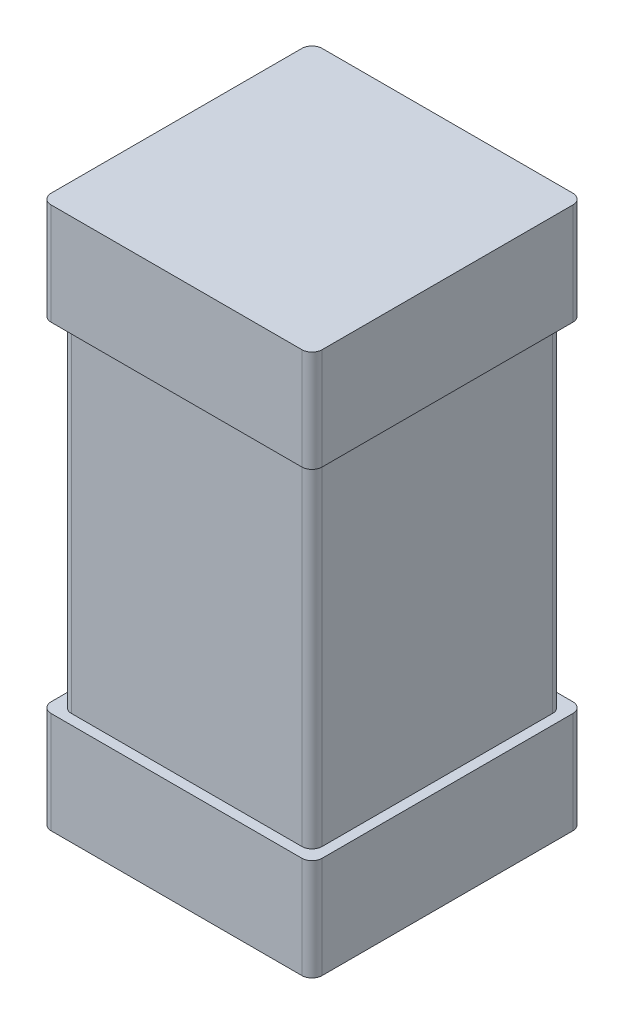
ISO-10303-21;
HEADER;
FILE_DESCRIPTION(('STEP AP214'),'2;1');
FILE_NAME('part.step','',(''),(''),'','','');
FILE_SCHEMA(('AUTOMOTIVE_DESIGN { 1 0 10303 214 1 1 1 1 }'));
ENDSEC;
DATA;
#1=APPLICATION_CONTEXT('core data for automotive mechanical design processes');
#2=APPLICATION_PROTOCOL_DEFINITION('international standard','automotive_design',2000,#1);
#3=PRODUCT_CONTEXT('',#1,'mechanical');
#4=PRODUCT('Part','Part','',(#3));
#5=PRODUCT_RELATED_PRODUCT_CATEGORY('part','',(#4));
#6=PRODUCT_DEFINITION_FORMATION('','',#4);
#7=PRODUCT_DEFINITION_CONTEXT('part definition',#1,'design');
#8=PRODUCT_DEFINITION('design','',#6,#7);
#9=PRODUCT_DEFINITION_SHAPE('','',#8);
#10=(LENGTH_UNIT() NAMED_UNIT(*) SI_UNIT(.MILLI.,.METRE.));
#11=(NAMED_UNIT(*) PLANE_ANGLE_UNIT() SI_UNIT($,.RADIAN.));
#12=(NAMED_UNIT(*) SI_UNIT($,.STERADIAN.) SOLID_ANGLE_UNIT());
#13=UNCERTAINTY_MEASURE_WITH_UNIT(LENGTH_MEASURE(1.E-05),#10,'distance_accuracy_value','');
#14=(GEOMETRIC_REPRESENTATION_CONTEXT(3) GLOBAL_UNCERTAINTY_ASSIGNED_CONTEXT((#13)) GLOBAL_UNIT_ASSIGNED_CONTEXT((#10,
#11,#12)) REPRESENTATION_CONTEXT('',''));
#15=CARTESIAN_POINT('',(0.,0.,0.));
#16=DIRECTION('',(0.,0.,1.));
#17=DIRECTION('',(1.,0.,0.));
#18=AXIS2_PLACEMENT_3D('',#15,#16,#17);
#19=CARTESIAN_POINT('',(126.370744279938,110.31204329235,142.211582908599));
#20=DIRECTION('',(0.,1.,0.));
#21=DIRECTION('',(1.,0.,0.));
#22=AXIS2_PLACEMENT_3D('',#19,#20,#21);
#23=PLANE('',#22);
#24=DIRECTION('',(0.,0.,1.));
#25=VECTOR('',#24,1.);
#26=CARTESIAN_POINT('',(126.370744279938,110.31204329235,142.211582908599));
#27=LINE('',#26,#25);
#28=CARTESIAN_POINT('',(126.370744279938,110.31204329235,142.241582908599));
#29=VERTEX_POINT('',#28);
#30=CARTESIAN_POINT('',(126.370744279938,110.31204329235,142.981582908599));
#31=VERTEX_POINT('',#30);
#32=EDGE_CURVE('E67',#29,#31,#27,.T.);
#33=ORIENTED_EDGE('',*,*,#32,.F.);
#34=CARTESIAN_POINT('',(126.340744279938,110.31204329235,142.241582908599));
#35=DIRECTION('',(0.,1.,0.));
#36=DIRECTION('',(0.,0.,1.));
#37=AXIS2_PLACEMENT_3D('',#34,#35,#36);
#38=CIRCLE('',#37,0.0300000000000023);
#39=CARTESIAN_POINT('',(126.340744279938,110.31204329235,142.211582908599));
#40=VERTEX_POINT('',#39);
#41=EDGE_CURVE('E11',#29,#40,#38,.T.);
#42=ORIENTED_EDGE('',*,*,#41,.T.);
#43=DIRECTION('',(-1.,0.,0.));
#44=VECTOR('',#43,1.);
#45=CARTESIAN_POINT('',(126.370744279938,110.31204329235,142.211582908599));
#46=LINE('',#45,#44);
#47=CARTESIAN_POINT('',(125.600744279938,110.31204329235,142.211582908599));
#48=VERTEX_POINT('',#47);
#49=EDGE_CURVE('E55',#40,#48,#46,.T.);
#50=ORIENTED_EDGE('',*,*,#49,.T.);
#51=CARTESIAN_POINT('',(125.600744279938,110.31204329235,142.241582908599));
#52=DIRECTION('',(0.,-1.,0.));
#53=DIRECTION('',(0.,0.,1.));
#54=AXIS2_PLACEMENT_3D('',#51,#52,#53);
#55=CIRCLE('',#54,0.0300000000000023);
#56=CARTESIAN_POINT('',(125.570744279938,110.31204329235,142.241582908599));
#57=VERTEX_POINT('',#56);
#58=EDGE_CURVE('E324',#57,#48,#55,.T.);
#59=ORIENTED_EDGE('',*,*,#58,.F.);
#60=DIRECTION('',(0.,0.,1.));
#61=VECTOR('',#60,1.);
#62=CARTESIAN_POINT('',(125.570744279938,110.31204329235,142.211582908599));
#63=LINE('',#62,#61);
#64=CARTESIAN_POINT('',(125.570744279938,110.31204329235,142.981582908599));
#65=VERTEX_POINT('',#64);
#66=EDGE_CURVE('E457',#57,#65,#63,.T.);
#67=ORIENTED_EDGE('',*,*,#66,.T.);
#68=CARTESIAN_POINT('',(125.600744279938,110.31204329235,142.981582908599));
#69=DIRECTION('',(0.,1.,0.));
#70=DIRECTION('',(0.,0.,1.));
#71=AXIS2_PLACEMENT_3D('',#68,#69,#70);
#72=CIRCLE('',#71,0.0300000000000023);
#73=CARTESIAN_POINT('',(125.600744279938,110.31204329235,143.011582908599));
#74=VERTEX_POINT('',#73);
#75=EDGE_CURVE('E391',#65,#74,#72,.T.);
#76=ORIENTED_EDGE('',*,*,#75,.T.);
#77=DIRECTION('',(-1.,0.,0.));
#78=VECTOR('',#77,1.);
#79=CARTESIAN_POINT('',(126.370744279938,110.31204329235,143.011582908599));
#80=LINE('',#79,#78);
#81=CARTESIAN_POINT('',(126.340744279938,110.31204329235,143.011582908599));
#82=VERTEX_POINT('',#81);
#83=EDGE_CURVE('E308',#82,#74,#80,.T.);
#84=ORIENTED_EDGE('',*,*,#83,.F.);
#85=CARTESIAN_POINT('',(126.340744279938,110.31204329235,142.981582908599));
#86=DIRECTION('',(0.,-1.,0.));
#87=DIRECTION('',(0.,0.,1.));
#88=AXIS2_PLACEMENT_3D('',#85,#86,#87);
#89=CIRCLE('',#88,0.0300000000000023);
#90=EDGE_CURVE('E318',#31,#82,#89,.T.);
#91=ORIENTED_EDGE('',*,*,#90,.F.);
#92=EDGE_LOOP('',(#33,#42,#50,#59,#67,#76,#84,#91));
#93=FACE_BOUND('',#92,.T.);
#94=ADVANCED_FACE('F44',(#93),#23,.T.);
#95=CARTESIAN_POINT('',(125.570744279938,110.01204329235,142.211582908599));
#96=DIRECTION('',(-1.,0.,0.));
#97=DIRECTION('',(0.,0.,1.));
#98=AXIS2_PLACEMENT_3D('',#95,#96,#97);
#99=PLANE('',#98);
#100=ORIENTED_EDGE('',*,*,#66,.F.);
#101=DIRECTION('',(0.,1.,0.));
#102=VECTOR('',#101,1.);
#103=CARTESIAN_POINT('',(125.570744279938,110.01204329235,142.241582908599));
#104=LINE('',#103,#102);
#105=CARTESIAN_POINT('',(125.570744279938,110.01204329235,142.241582908599));
#106=VERTEX_POINT('',#105);
#107=EDGE_CURVE('E319',#106,#57,#104,.T.);
#108=ORIENTED_EDGE('',*,*,#107,.F.);
#109=DIRECTION('',(0.,0.,1.));
#110=VECTOR('',#109,1.);
#111=CARTESIAN_POINT('',(125.570744279938,110.01204329235,142.211582908599));
#112=LINE('',#111,#110);
#113=CARTESIAN_POINT('',(125.570744279938,110.01204329235,142.981582908599));
#114=VERTEX_POINT('',#113);
#115=EDGE_CURVE('E387',#106,#114,#112,.T.);
#116=ORIENTED_EDGE('',*,*,#115,.T.);
#117=DIRECTION('',(0.,1.,0.));
#118=VECTOR('',#117,1.);
#119=CARTESIAN_POINT('',(125.570744279938,110.01204329235,142.981582908599));
#120=LINE('',#119,#118);
#121=EDGE_CURVE('E392',#114,#65,#120,.T.);
#122=ORIENTED_EDGE('',*,*,#121,.T.);
#123=EDGE_LOOP('',(#100,#108,#116,#122));
#124=FACE_BOUND('',#123,.T.);
#125=ADVANCED_FACE('F548',(#124),#99,.T.);
#126=CARTESIAN_POINT('',(125.600744279938,110.01204329235,142.981582908599));
#127=DIRECTION('',(0.,1.,0.));
#128=DIRECTION('',(-1.,0.,0.));
#129=AXIS2_PLACEMENT_3D('',#126,#127,#128);
#130=CYLINDRICAL_SURFACE('',#129,0.0300000000000023);
#131=CARTESIAN_POINT('',(125.600744279938,110.01204329235,142.981582908599));
#132=DIRECTION('',(0.,1.,0.));
#133=DIRECTION('',(0.,0.,1.));
#134=AXIS2_PLACEMENT_3D('',#131,#132,#133);
#135=CIRCLE('',#134,0.0300000000000023);
#136=CARTESIAN_POINT('',(125.600744279938,110.01204329235,143.011582908599));
#137=VERTEX_POINT('',#136);
#138=EDGE_CURVE('E396',#114,#137,#135,.T.);
#139=ORIENTED_EDGE('',*,*,#138,.T.);
#140=DIRECTION('',(0.,1.,0.));
#141=VECTOR('',#140,1.);
#142=CARTESIAN_POINT('',(125.600744279938,110.01204329235,143.011582908599));
#143=LINE('',#142,#141);
#144=EDGE_CURVE('E323',#137,#74,#143,.T.);
#145=ORIENTED_EDGE('',*,*,#144,.T.);
#146=ORIENTED_EDGE('',*,*,#75,.F.);
#147=ORIENTED_EDGE('',*,*,#121,.F.);
#148=EDGE_LOOP('',(#139,#145,#146,#147));
#149=FACE_BOUND('',#148,.T.);
#150=ADVANCED_FACE('F553',(#149),#130,.T.);
#151=CARTESIAN_POINT('',(125.600744279938,110.01204329235,142.241582908599));
#152=DIRECTION('',(0.,1.,0.));
#153=DIRECTION('',(-1.,0.,0.));
#154=AXIS2_PLACEMENT_3D('',#151,#152,#153);
#155=CYLINDRICAL_SURFACE('',#154,0.0300000000000023);
#156=ORIENTED_EDGE('',*,*,#107,.T.);
#157=ORIENTED_EDGE('',*,*,#58,.T.);
#158=DIRECTION('',(0.,1.,0.));
#159=VECTOR('',#158,1.);
#160=CARTESIAN_POINT('',(125.600744279938,110.01204329235,142.211582908599));
#161=LINE('',#160,#159);
#162=CARTESIAN_POINT('',(125.600744279938,110.01204329235,142.211582908599));
#163=VERTEX_POINT('',#162);
#164=EDGE_CURVE('E312',#163,#48,#161,.T.);
#165=ORIENTED_EDGE('',*,*,#164,.F.);
#166=CARTESIAN_POINT('',(125.600744279938,110.01204329235,142.241582908599));
#167=DIRECTION('',(0.,-1.,0.));
#168=DIRECTION('',(0.,0.,1.));
#169=AXIS2_PLACEMENT_3D('',#166,#167,#168);
#170=CIRCLE('',#169,0.0300000000000023);
#171=EDGE_CURVE('E370',#106,#163,#170,.T.);
#172=ORIENTED_EDGE('',*,*,#171,.F.);
#173=EDGE_LOOP('',(#156,#157,#165,#172));
#174=FACE_BOUND('',#173,.T.);
#175=ADVANCED_FACE('F545',(#174),#155,.T.);
#176=CARTESIAN_POINT('',(126.370744279938,110.01204329235,143.011582908599));
#177=DIRECTION('',(0.,0.,1.));
#178=DIRECTION('',(1.,0.,0.));
#179=AXIS2_PLACEMENT_3D('',#176,#177,#178);
#180=PLANE('',#179);
#181=DIRECTION('',(-1.,0.,0.));
#182=VECTOR('',#181,1.);
#183=CARTESIAN_POINT('',(126.370744279938,110.01204329235,143.011582908599));
#184=LINE('',#183,#182);
#185=CARTESIAN_POINT('',(126.340744279938,110.01204329235,143.011582908599));
#186=VERTEX_POINT('',#185);
#187=EDGE_CURVE('E360',#186,#137,#184,.T.);
#188=ORIENTED_EDGE('',*,*,#187,.F.);
#189=DIRECTION('',(0.,1.,0.));
#190=VECTOR('',#189,1.);
#191=CARTESIAN_POINT('',(126.340744279938,110.01204329235,143.011582908599));
#192=LINE('',#191,#190);
#193=EDGE_CURVE('E311',#186,#82,#192,.T.);
#194=ORIENTED_EDGE('',*,*,#193,.T.);
#195=ORIENTED_EDGE('',*,*,#83,.T.);
#196=ORIENTED_EDGE('',*,*,#144,.F.);
#197=EDGE_LOOP('',(#188,#194,#195,#196));
#198=FACE_BOUND('',#197,.T.);
#199=ADVANCED_FACE('F575',(#198),#180,.T.);
#200=CARTESIAN_POINT('',(126.370744279938,110.01204329235,142.211582908599));
#201=DIRECTION('',(0.,0.,1.));
#202=DIRECTION('',(1.,0.,0.));
#203=AXIS2_PLACEMENT_3D('',#200,#201,#202);
#204=PLANE('',#203);
#205=ORIENTED_EDGE('',*,*,#164,.T.);
#206=ORIENTED_EDGE('',*,*,#49,.F.);
#207=DIRECTION('',(0.,1.,0.));
#208=VECTOR('',#207,1.);
#209=CARTESIAN_POINT('',(126.340744279938,110.01204329235,142.211582908599));
#210=LINE('',#209,#208);
#211=CARTESIAN_POINT('',(126.340744279938,110.01204329235,142.211582908599));
#212=VERTEX_POINT('',#211);
#213=EDGE_CURVE('E351',#212,#40,#210,.T.);
#214=ORIENTED_EDGE('',*,*,#213,.F.);
#215=DIRECTION('',(-1.,0.,0.));
#216=VECTOR('',#215,1.);
#217=CARTESIAN_POINT('',(126.370744279938,110.01204329235,142.211582908599));
#218=LINE('',#217,#216);
#219=EDGE_CURVE('E317',#212,#163,#218,.T.);
#220=ORIENTED_EDGE('',*,*,#219,.T.);
#221=EDGE_LOOP('',(#205,#206,#214,#220));
#222=FACE_BOUND('',#221,.T.);
#223=ADVANCED_FACE('F539',(#222),#204,.F.);
#224=CARTESIAN_POINT('',(126.340744279938,110.01204329235,142.981582908599));
#225=DIRECTION('',(0.,1.,0.));
#226=DIRECTION('',(1.,0.,0.));
#227=AXIS2_PLACEMENT_3D('',#224,#225,#226);
#228=CYLINDRICAL_SURFACE('',#227,0.0300000000000023);
#229=DIRECTION('',(0.,1.,0.));
#230=VECTOR('',#229,1.);
#231=CARTESIAN_POINT('',(126.370744279938,110.01204329235,142.981582908599));
#232=LINE('',#231,#230);
#233=CARTESIAN_POINT('',(126.370744279938,110.01204329235,142.981582908599));
#234=VERTEX_POINT('',#233);
#235=EDGE_CURVE('E313',#234,#31,#232,.T.);
#236=ORIENTED_EDGE('',*,*,#235,.T.);
#237=ORIENTED_EDGE('',*,*,#90,.T.);
#238=ORIENTED_EDGE('',*,*,#193,.F.);
#239=CARTESIAN_POINT('',(126.340744279938,110.01204329235,142.981582908599));
#240=DIRECTION('',(0.,-1.,0.));
#241=DIRECTION('',(0.,0.,1.));
#242=AXIS2_PLACEMENT_3D('',#239,#240,#241);
#243=CIRCLE('',#242,0.0300000000000023);
#244=EDGE_CURVE('E357',#234,#186,#243,.T.);
#245=ORIENTED_EDGE('',*,*,#244,.F.);
#246=EDGE_LOOP('',(#236,#237,#238,#245));
#247=FACE_BOUND('',#246,.T.);
#248=ADVANCED_FACE('F566',(#247),#228,.T.);
#249=CARTESIAN_POINT('',(126.340744279938,110.01204329235,142.241582908599));
#250=DIRECTION('',(0.,1.,0.));
#251=DIRECTION('',(1.,0.,0.));
#252=AXIS2_PLACEMENT_3D('',#249,#250,#251);
#253=CYLINDRICAL_SURFACE('',#252,0.0300000000000023);
#254=CARTESIAN_POINT('',(126.340744279938,110.01204329235,142.241582908599));
#255=DIRECTION('',(0.,1.,0.));
#256=DIRECTION('',(0.,0.,1.));
#257=AXIS2_PLACEMENT_3D('',#254,#255,#256);
#258=CIRCLE('',#257,0.0300000000000023);
#259=CARTESIAN_POINT('',(126.370744279938,110.01204329235,142.241582908599));
#260=VERTEX_POINT('',#259);
#261=EDGE_CURVE('E347',#260,#212,#258,.T.);
#262=ORIENTED_EDGE('',*,*,#261,.T.);
#263=ORIENTED_EDGE('',*,*,#213,.T.);
#264=ORIENTED_EDGE('',*,*,#41,.F.);
#265=DIRECTION('',(0.,1.,0.));
#266=VECTOR('',#265,1.);
#267=CARTESIAN_POINT('',(126.370744279938,110.01204329235,142.241582908599));
#268=LINE('',#267,#266);
#269=EDGE_CURVE('E367',#260,#29,#268,.T.);
#270=ORIENTED_EDGE('',*,*,#269,.F.);
#271=EDGE_LOOP('',(#262,#263,#264,#270));
#272=FACE_BOUND('',#271,.T.);
#273=ADVANCED_FACE('F535',(#272),#253,.T.);
#274=CARTESIAN_POINT('',(126.370744279938,110.01204329235,142.211582908599));
#275=DIRECTION('',(-1.,0.,0.));
#276=DIRECTION('',(0.,0.,1.));
#277=AXIS2_PLACEMENT_3D('',#274,#275,#276);
#278=PLANE('',#277);
#279=ORIENTED_EDGE('',*,*,#235,.F.);
#280=DIRECTION('',(0.,0.,1.));
#281=VECTOR('',#280,1.);
#282=CARTESIAN_POINT('',(126.370744279938,110.01204329235,142.211582908599));
#283=LINE('',#282,#281);
#284=EDGE_CURVE('E377',#260,#234,#283,.T.);
#285=ORIENTED_EDGE('',*,*,#284,.F.);
#286=ORIENTED_EDGE('',*,*,#269,.T.);
#287=ORIENTED_EDGE('',*,*,#32,.T.);
#288=EDGE_LOOP('',(#279,#285,#286,#287));
#289=FACE_BOUND('',#288,.T.);
#290=ADVANCED_FACE('F563',(#289),#278,.F.);
#291=CARTESIAN_POINT('',(126.370744279938,110.01204329235,142.211582908599));
#292=DIRECTION('',(0.,1.,0.));
#293=DIRECTION('',(1.,0.,0.));
#294=AXIS2_PLACEMENT_3D('',#291,#292,#293);
#295=PLANE('',#294);
#296=ORIENTED_EDGE('',*,*,#244,.T.);
#297=ORIENTED_EDGE('',*,*,#187,.T.);
#298=ORIENTED_EDGE('',*,*,#138,.F.);
#299=ORIENTED_EDGE('',*,*,#115,.F.);
#300=ORIENTED_EDGE('',*,*,#171,.T.);
#301=ORIENTED_EDGE('',*,*,#219,.F.);
#302=ORIENTED_EDGE('',*,*,#261,.F.);
#303=ORIENTED_EDGE('',*,*,#284,.T.);
#304=EDGE_LOOP('',(#296,#297,#298,#299,#300,#301,#302,#303));
#305=FACE_BOUND('',#304,.T.);
#306=DIRECTION('',(-1.,0.,0.));
#307=VECTOR('',#306,1.);
#308=CARTESIAN_POINT('',(126.340744279938,110.01204329235,142.241582908599));
#309=LINE('',#308,#307);
#310=CARTESIAN_POINT('',(126.310744279938,110.01204329235,142.241582908599));
#311=VERTEX_POINT('',#310);
#312=CARTESIAN_POINT('',(125.630744279938,110.01204329235,142.241582908599));
#313=VERTEX_POINT('',#312);
#314=EDGE_CURVE('E422',#311,#313,#309,.T.);
#315=ORIENTED_EDGE('',*,*,#314,.T.);
#316=CARTESIAN_POINT('',(125.630744279938,110.01204329235,142.271582908599));
#317=DIRECTION('',(0.,-1.,0.));
#318=DIRECTION('',(0.,0.,1.));
#319=AXIS2_PLACEMENT_3D('',#316,#317,#318);
#320=CIRCLE('',#319,0.0300000000000023);
#321=CARTESIAN_POINT('',(125.600744279938,110.01204329235,142.271582908599));
#322=VERTEX_POINT('',#321);
#323=EDGE_CURVE('E428',#322,#313,#320,.T.);
#324=ORIENTED_EDGE('',*,*,#323,.F.);
#325=DIRECTION('',(0.,0.,1.));
#326=VECTOR('',#325,1.);
#327=CARTESIAN_POINT('',(125.600744279938,110.01204329235,142.241582908599));
#328=LINE('',#327,#326);
#329=CARTESIAN_POINT('',(125.600744279938,110.01204329235,142.951582908599));
#330=VERTEX_POINT('',#329);
#331=EDGE_CURVE('E278',#322,#330,#328,.T.);
#332=ORIENTED_EDGE('',*,*,#331,.T.);
#333=CARTESIAN_POINT('',(125.630744279938,110.01204329235,142.951582908599));
#334=DIRECTION('',(0.,1.,0.));
#335=DIRECTION('',(0.,0.,1.));
#336=AXIS2_PLACEMENT_3D('',#333,#334,#335);
#337=CIRCLE('',#336,0.0300000000000023);
#338=CARTESIAN_POINT('',(125.630744279938,110.01204329235,142.981582908599));
#339=VERTEX_POINT('',#338);
#340=EDGE_CURVE('E274',#330,#339,#337,.T.);
#341=ORIENTED_EDGE('',*,*,#340,.T.);
#342=DIRECTION('',(-1.,0.,0.));
#343=VECTOR('',#342,1.);
#344=CARTESIAN_POINT('',(126.340744279938,110.01204329235,142.981582908599));
#345=LINE('',#344,#343);
#346=CARTESIAN_POINT('',(126.310744279938,110.01204329235,142.981582908599));
#347=VERTEX_POINT('',#346);
#348=EDGE_CURVE('E259',#347,#339,#345,.T.);
#349=ORIENTED_EDGE('',*,*,#348,.F.);
#350=CARTESIAN_POINT('',(126.310744279938,110.01204329235,142.951582908599));
#351=DIRECTION('',(0.,-1.,0.));
#352=DIRECTION('',(0.,0.,1.));
#353=AXIS2_PLACEMENT_3D('',#350,#351,#352);
#354=CIRCLE('',#353,0.0300000000000023);
#355=CARTESIAN_POINT('',(126.340744279938,110.01204329235,142.951582908599));
#356=VERTEX_POINT('',#355);
#357=EDGE_CURVE('E467',#356,#347,#354,.T.);
#358=ORIENTED_EDGE('',*,*,#357,.F.);
#359=DIRECTION('',(0.,0.,1.));
#360=VECTOR('',#359,1.);
#361=CARTESIAN_POINT('',(126.340744279938,110.01204329235,142.241582908599));
#362=LINE('',#361,#360);
#363=CARTESIAN_POINT('',(126.340744279938,110.01204329235,142.271582908599));
#364=VERTEX_POINT('',#363);
#365=EDGE_CURVE('E352',#364,#356,#362,.T.);
#366=ORIENTED_EDGE('',*,*,#365,.F.);
#367=CARTESIAN_POINT('',(126.310744279938,110.01204329235,142.271582908599));
#368=DIRECTION('',(0.,1.,0.));
#369=DIRECTION('',(0.,0.,1.));
#370=AXIS2_PLACEMENT_3D('',#367,#368,#369);
#371=CIRCLE('',#370,0.0300000000000023);
#372=EDGE_CURVE('E282',#364,#311,#371,.T.);
#373=ORIENTED_EDGE('',*,*,#372,.T.);
#374=EDGE_LOOP('',(#315,#324,#332,#341,#349,#358,#366,#373));
#375=FACE_BOUND('',#374,.T.);
#376=ADVANCED_FACE('F276',(#305,#375),#295,.F.);
#377=CARTESIAN_POINT('',(126.340744279938,109.01204329235,142.241582908599));
#378=DIRECTION('',(-1.,0.,0.));
#379=DIRECTION('',(0.,0.,1.));
#380=AXIS2_PLACEMENT_3D('',#377,#378,#379);
#381=PLANE('',#380);
#382=DIRECTION('',(0.,1.,0.));
#383=VECTOR('',#382,1.);
#384=CARTESIAN_POINT('',(126.340744279938,109.01204329235,142.951582908599));
#385=LINE('',#384,#383);
#386=CARTESIAN_POINT('',(126.340744279938,109.01204329235,142.951582908599));
#387=VERTEX_POINT('',#386);
#388=EDGE_CURVE('E356',#387,#356,#385,.T.);
#389=ORIENTED_EDGE('',*,*,#388,.F.);
#390=DIRECTION('',(0.,0.,1.));
#391=VECTOR('',#390,1.);
#392=CARTESIAN_POINT('',(126.340744279938,109.01204329235,142.241582908599));
#393=LINE('',#392,#391);
#394=CARTESIAN_POINT('',(126.340744279938,109.01204329235,142.271582908599));
#395=VERTEX_POINT('',#394);
#396=EDGE_CURVE('E397',#395,#387,#393,.T.);
#397=ORIENTED_EDGE('',*,*,#396,.F.);
#398=DIRECTION('',(0.,1.,0.));
#399=VECTOR('',#398,1.);
#400=CARTESIAN_POINT('',(126.340744279938,109.01204329235,142.271582908599));
#401=LINE('',#400,#399);
#402=EDGE_CURVE('E355',#395,#364,#401,.T.);
#403=ORIENTED_EDGE('',*,*,#402,.T.);
#404=ORIENTED_EDGE('',*,*,#365,.T.);
#405=EDGE_LOOP('',(#389,#397,#403,#404));
#406=FACE_BOUND('',#405,.T.);
#407=ADVANCED_FACE('F562',(#406),#381,.F.);
#408=CARTESIAN_POINT('',(126.310744279938,109.01204329235,142.951582908599));
#409=DIRECTION('',(0.,1.,0.));
#410=DIRECTION('',(1.,0.,0.));
#411=AXIS2_PLACEMENT_3D('',#408,#409,#410);
#412=CYLINDRICAL_SURFACE('',#411,0.0300000000000023);
#413=ORIENTED_EDGE('',*,*,#388,.T.);
#414=ORIENTED_EDGE('',*,*,#357,.T.);
#415=DIRECTION('',(0.,1.,0.));
#416=VECTOR('',#415,1.);
#417=CARTESIAN_POINT('',(126.310744279938,109.01204329235,142.981582908599));
#418=LINE('',#417,#416);
#419=CARTESIAN_POINT('',(126.310744279938,109.01204329235,142.981582908599));
#420=VERTEX_POINT('',#419);
#421=EDGE_CURVE('E267',#420,#347,#418,.T.);
#422=ORIENTED_EDGE('',*,*,#421,.F.);
#423=CARTESIAN_POINT('',(126.310744279938,109.01204329235,142.951582908599));
#424=DIRECTION('',(0.,-1.,0.));
#425=DIRECTION('',(0.,0.,1.));
#426=AXIS2_PLACEMENT_3D('',#423,#424,#425);
#427=CIRCLE('',#426,0.0300000000000023);
#428=EDGE_CURVE('E400',#387,#420,#427,.T.);
#429=ORIENTED_EDGE('',*,*,#428,.F.);
#430=EDGE_LOOP('',(#413,#414,#422,#429));
#431=FACE_BOUND('',#430,.T.);
#432=ADVANCED_FACE('F46',(#431),#412,.T.);
#433=CARTESIAN_POINT('',(126.340744279938,109.01204329235,142.981582908599));
#434=DIRECTION('',(0.,0.,1.));
#435=DIRECTION('',(1.,0.,0.));
#436=AXIS2_PLACEMENT_3D('',#433,#434,#435);
#437=PLANE('',#436);
#438=DIRECTION('',(-1.,0.,0.));
#439=VECTOR('',#438,1.);
#440=CARTESIAN_POINT('',(126.340744279938,109.01204329235,142.981582908599));
#441=LINE('',#440,#439);
#442=CARTESIAN_POINT('',(125.630744279938,109.01204329235,142.981582908599));
#443=VERTEX_POINT('',#442);
#444=EDGE_CURVE('E334',#420,#443,#441,.T.);
#445=ORIENTED_EDGE('',*,*,#444,.F.);
#446=ORIENTED_EDGE('',*,*,#421,.T.);
#447=ORIENTED_EDGE('',*,*,#348,.T.);
#448=DIRECTION('',(0.,1.,0.));
#449=VECTOR('',#448,1.);
#450=CARTESIAN_POINT('',(125.630744279938,109.01204329235,142.981582908599));
#451=LINE('',#450,#449);
#452=EDGE_CURVE('E264',#443,#339,#451,.T.);
#453=ORIENTED_EDGE('',*,*,#452,.F.);
#454=EDGE_LOOP('',(#445,#446,#447,#453));
#455=FACE_BOUND('',#454,.T.);
#456=ADVANCED_FACE('F262',(#455),#437,.T.);
#457=CARTESIAN_POINT('',(125.630744279938,109.01204329235,142.951582908599));
#458=DIRECTION('',(0.,1.,0.));
#459=DIRECTION('',(-1.,0.,0.));
#460=AXIS2_PLACEMENT_3D('',#457,#458,#459);
#461=CYLINDRICAL_SURFACE('',#460,0.0300000000000023);
#462=CARTESIAN_POINT('',(125.630744279938,109.01204329235,142.951582908599));
#463=DIRECTION('',(0.,1.,0.));
#464=DIRECTION('',(0.,0.,1.));
#465=AXIS2_PLACEMENT_3D('',#462,#463,#464);
#466=CIRCLE('',#465,0.0300000000000023);
#467=CARTESIAN_POINT('',(125.600744279938,109.01204329235,142.951582908599));
#468=VERTEX_POINT('',#467);
#469=EDGE_CURVE('E271',#468,#443,#466,.T.);
#470=ORIENTED_EDGE('',*,*,#469,.T.);
#471=ORIENTED_EDGE('',*,*,#452,.T.);
#472=ORIENTED_EDGE('',*,*,#340,.F.);
#473=DIRECTION('',(0.,1.,0.));
#474=VECTOR('',#473,1.);
#475=CARTESIAN_POINT('',(125.600744279938,109.01204329235,142.951582908599));
#476=LINE('',#475,#474);
#477=EDGE_CURVE('E48',#468,#330,#476,.T.);
#478=ORIENTED_EDGE('',*,*,#477,.F.);
#479=EDGE_LOOP('',(#470,#471,#472,#478));
#480=FACE_BOUND('',#479,.T.);
#481=ADVANCED_FACE('F284',(#480),#461,.T.);
#482=CARTESIAN_POINT('',(125.600744279938,109.01204329235,142.241582908599));
#483=DIRECTION('',(-1.,0.,0.));
#484=DIRECTION('',(0.,0.,1.));
#485=AXIS2_PLACEMENT_3D('',#482,#483,#484);
#486=PLANE('',#485);
#487=ORIENTED_EDGE('',*,*,#331,.F.);
#488=DIRECTION('',(0.,1.,0.));
#489=VECTOR('',#488,1.);
#490=CARTESIAN_POINT('',(125.600744279938,109.01204329235,142.271582908599));
#491=LINE('',#490,#489);
#492=CARTESIAN_POINT('',(125.600744279938,109.01204329235,142.271582908599));
#493=VERTEX_POINT('',#492);
#494=EDGE_CURVE('E431',#493,#322,#491,.T.);
#495=ORIENTED_EDGE('',*,*,#494,.F.);
#496=DIRECTION('',(0.,0.,1.));
#497=VECTOR('',#496,1.);
#498=CARTESIAN_POINT('',(125.600744279938,109.01204329235,142.241582908599));
#499=LINE('',#498,#497);
#500=EDGE_CURVE('E287',#493,#468,#499,.T.);
#501=ORIENTED_EDGE('',*,*,#500,.T.);
#502=ORIENTED_EDGE('',*,*,#477,.T.);
#503=EDGE_LOOP('',(#487,#495,#501,#502));
#504=FACE_BOUND('',#503,.T.);
#505=ADVANCED_FACE('F583',(#504),#486,.T.);
#506=CARTESIAN_POINT('',(125.630744279938,109.01204329235,142.271582908599));
#507=DIRECTION('',(0.,1.,0.));
#508=DIRECTION('',(-1.,0.,0.));
#509=AXIS2_PLACEMENT_3D('',#506,#507,#508);
#510=CYLINDRICAL_SURFACE('',#509,0.0300000000000023);
#511=ORIENTED_EDGE('',*,*,#494,.T.);
#512=ORIENTED_EDGE('',*,*,#323,.T.);
#513=DIRECTION('',(0.,1.,0.));
#514=VECTOR('',#513,1.);
#515=CARTESIAN_POINT('',(125.630744279938,109.01204329235,142.241582908599));
#516=LINE('',#515,#514);
#517=CARTESIAN_POINT('',(125.630744279938,109.01204329235,142.241582908599));
#518=VERTEX_POINT('',#517);
#519=EDGE_CURVE('E432',#518,#313,#516,.T.);
#520=ORIENTED_EDGE('',*,*,#519,.F.);
#521=CARTESIAN_POINT('',(125.630744279938,109.01204329235,142.271582908599));
#522=DIRECTION('',(0.,-1.,0.));
#523=DIRECTION('',(0.,0.,1.));
#524=AXIS2_PLACEMENT_3D('',#521,#522,#523);
#525=CIRCLE('',#524,0.0300000000000023);
#526=EDGE_CURVE('E331',#493,#518,#525,.T.);
#527=ORIENTED_EDGE('',*,*,#526,.F.);
#528=EDGE_LOOP('',(#511,#512,#520,#527));
#529=FACE_BOUND('',#528,.T.);
#530=ADVANCED_FACE('F579',(#529),#510,.T.);
#531=CARTESIAN_POINT('',(126.340744279938,109.01204329235,142.241582908599));
#532=DIRECTION('',(0.,0.,1.));
#533=DIRECTION('',(1.,0.,0.));
#534=AXIS2_PLACEMENT_3D('',#531,#532,#533);
#535=PLANE('',#534);
#536=ORIENTED_EDGE('',*,*,#519,.T.);
#537=ORIENTED_EDGE('',*,*,#314,.F.);
#538=DIRECTION('',(0.,1.,0.));
#539=VECTOR('',#538,1.);
#540=CARTESIAN_POINT('',(126.310744279938,109.01204329235,142.241582908599));
#541=LINE('',#540,#539);
#542=CARTESIAN_POINT('',(126.310744279938,109.01204329235,142.241582908599));
#543=VERTEX_POINT('',#542);
#544=EDGE_CURVE('E109',#543,#311,#541,.T.);
#545=ORIENTED_EDGE('',*,*,#544,.F.);
#546=DIRECTION('',(-1.,0.,0.));
#547=VECTOR('',#546,1.);
#548=CARTESIAN_POINT('',(126.340744279938,109.01204329235,142.241582908599));
#549=LINE('',#548,#547);
#550=EDGE_CURVE('E426',#543,#518,#549,.T.);
#551=ORIENTED_EDGE('',*,*,#550,.T.);
#552=EDGE_LOOP('',(#536,#537,#545,#551));
#553=FACE_BOUND('',#552,.T.);
#554=ADVANCED_FACE('F582',(#553),#535,.F.);
#555=CARTESIAN_POINT('',(126.310744279938,109.01204329235,142.271582908599));
#556=DIRECTION('',(0.,1.,0.));
#557=DIRECTION('',(1.,0.,0.));
#558=AXIS2_PLACEMENT_3D('',#555,#556,#557);
#559=CYLINDRICAL_SURFACE('',#558,0.0300000000000023);
#560=CARTESIAN_POINT('',(126.310744279938,109.01204329235,142.271582908599));
#561=DIRECTION('',(0.,1.,0.));
#562=DIRECTION('',(0.,0.,1.));
#563=AXIS2_PLACEMENT_3D('',#560,#561,#562);
#564=CIRCLE('',#563,0.0300000000000023);
#565=EDGE_CURVE('E423',#395,#543,#564,.T.);
#566=ORIENTED_EDGE('',*,*,#565,.T.);
#567=ORIENTED_EDGE('',*,*,#544,.T.);
#568=ORIENTED_EDGE('',*,*,#372,.F.);
#569=ORIENTED_EDGE('',*,*,#402,.F.);
#570=EDGE_LOOP('',(#566,#567,#568,#569));
#571=FACE_BOUND('',#570,.T.);
#572=ADVANCED_FACE('F590',(#571),#559,.T.);
#573=CARTESIAN_POINT('',(126.370744279938,109.01204329235,142.211582908599));
#574=DIRECTION('',(0.,1.,0.));
#575=DIRECTION('',(1.,0.,0.));
#576=AXIS2_PLACEMENT_3D('',#573,#574,#575);
#577=PLANE('',#576);
#578=DIRECTION('',(0.,0.,1.));
#579=VECTOR('',#578,1.);
#580=CARTESIAN_POINT('',(126.370744279938,109.01204329235,142.211582908599));
#581=LINE('',#580,#579);
#582=CARTESIAN_POINT('',(126.370744279938,109.01204329235,142.241582908599));
#583=VERTEX_POINT('',#582);
#584=CARTESIAN_POINT('',(126.370744279938,109.01204329235,142.981582908599));
#585=VERTEX_POINT('',#584);
#586=EDGE_CURVE('E125',#583,#585,#581,.T.);
#587=ORIENTED_EDGE('',*,*,#586,.F.);
#588=CARTESIAN_POINT('',(126.340744279938,109.01204329235,142.241582908599));
#589=DIRECTION('',(0.,1.,0.));
#590=DIRECTION('',(0.,0.,1.));
#591=AXIS2_PLACEMENT_3D('',#588,#589,#590);
#592=CIRCLE('',#591,0.0300000000000023);
#593=CARTESIAN_POINT('',(126.340744279938,109.01204329235,142.211582908599));
#594=VERTEX_POINT('',#593);
#595=EDGE_CURVE('E418',#583,#594,#592,.T.);
#596=ORIENTED_EDGE('',*,*,#595,.T.);
#597=DIRECTION('',(-1.,0.,0.));
#598=VECTOR('',#597,1.);
#599=CARTESIAN_POINT('',(126.370744279938,109.01204329235,142.211582908599));
#600=LINE('',#599,#598);
#601=CARTESIAN_POINT('',(125.600744279938,109.01204329235,142.211582908599));
#602=VERTEX_POINT('',#601);
#603=EDGE_CURVE('E414',#594,#602,#600,.T.);
#604=ORIENTED_EDGE('',*,*,#603,.T.);
#605=CARTESIAN_POINT('',(125.600744279938,109.01204329235,142.241582908599));
#606=DIRECTION('',(0.,-1.,0.));
#607=DIRECTION('',(0.,0.,1.));
#608=AXIS2_PLACEMENT_3D('',#605,#606,#607);
#609=CIRCLE('',#608,0.0300000000000023);
#610=CARTESIAN_POINT('',(125.570744279938,109.01204329235,142.241582908599));
#611=VERTEX_POINT('',#610);
#612=EDGE_CURVE('E456',#611,#602,#609,.T.);
#613=ORIENTED_EDGE('',*,*,#612,.F.);
#614=DIRECTION('',(0.,0.,1.));
#615=VECTOR('',#614,1.);
#616=CARTESIAN_POINT('',(125.570744279938,109.01204329235,142.211582908599));
#617=LINE('',#616,#615);
#618=CARTESIAN_POINT('',(125.570744279938,109.01204329235,142.981582908599));
#619=VERTEX_POINT('',#618);
#620=EDGE_CURVE('E419',#611,#619,#617,.T.);
#621=ORIENTED_EDGE('',*,*,#620,.T.);
#622=CARTESIAN_POINT('',(125.600744279938,109.01204329235,142.981582908599));
#623=DIRECTION('',(0.,1.,0.));
#624=DIRECTION('',(0.,0.,1.));
#625=AXIS2_PLACEMENT_3D('',#622,#623,#624);
#626=CIRCLE('',#625,0.0300000000000023);
#627=CARTESIAN_POINT('',(125.600744279938,109.01204329235,143.011582908599));
#628=VERTEX_POINT('',#627);
#629=EDGE_CURVE('E399',#619,#628,#626,.T.);
#630=ORIENTED_EDGE('',*,*,#629,.T.);
#631=DIRECTION('',(-1.,0.,0.));
#632=VECTOR('',#631,1.);
#633=CARTESIAN_POINT('',(126.370744279938,109.01204329235,143.011582908599));
#634=LINE('',#633,#632);
#635=CARTESIAN_POINT('',(126.340744279938,109.01204329235,143.011582908599));
#636=VERTEX_POINT('',#635);
#637=EDGE_CURVE('E402',#636,#628,#634,.T.);
#638=ORIENTED_EDGE('',*,*,#637,.F.);
#639=CARTESIAN_POINT('',(126.340744279938,109.01204329235,142.981582908599));
#640=DIRECTION('',(0.,-1.,0.));
#641=DIRECTION('',(0.,0.,1.));
#642=AXIS2_PLACEMENT_3D('',#639,#640,#641);
#643=CIRCLE('',#642,0.0300000000000023);
#644=EDGE_CURVE('E336',#585,#636,#643,.T.);
#645=ORIENTED_EDGE('',*,*,#644,.F.);
#646=EDGE_LOOP('',(#587,#596,#604,#613,#621,#630,#638,#645));
#647=FACE_BOUND('',#646,.T.);
#648=ORIENTED_EDGE('',*,*,#565,.F.);
#649=ORIENTED_EDGE('',*,*,#396,.T.);
#650=ORIENTED_EDGE('',*,*,#428,.T.);
#651=ORIENTED_EDGE('',*,*,#444,.T.);
#652=ORIENTED_EDGE('',*,*,#469,.F.);
#653=ORIENTED_EDGE('',*,*,#500,.F.);
#654=ORIENTED_EDGE('',*,*,#526,.T.);
#655=ORIENTED_EDGE('',*,*,#550,.F.);
#656=EDGE_LOOP('',(#648,#649,#650,#651,#652,#653,#654,#655));
#657=FACE_BOUND('',#656,.T.);
#658=ADVANCED_FACE('F594',(#647,#657),#577,.T.);
#659=CARTESIAN_POINT('',(125.570744279938,108.71204329235,142.211582908599));
#660=DIRECTION('',(-1.,0.,0.));
#661=DIRECTION('',(0.,0.,1.));
#662=AXIS2_PLACEMENT_3D('',#659,#660,#661);
#663=PLANE('',#662);
#664=ORIENTED_EDGE('',*,*,#620,.F.);
#665=DIRECTION('',(0.,1.,0.));
#666=VECTOR('',#665,1.);
#667=CARTESIAN_POINT('',(125.570744279938,108.71204329235,142.241582908599));
#668=LINE('',#667,#666);
#669=CARTESIAN_POINT('',(125.570744279938,108.71204329235,142.241582908599));
#670=VERTEX_POINT('',#669);
#671=EDGE_CURVE('E386',#670,#611,#668,.T.);
#672=ORIENTED_EDGE('',*,*,#671,.F.);
#673=DIRECTION('',(0.,0.,1.));
#674=VECTOR('',#673,1.);
#675=CARTESIAN_POINT('',(125.570744279938,108.71204329235,142.211582908599));
#676=LINE('',#675,#674);
#677=CARTESIAN_POINT('',(125.570744279938,108.71204329235,142.981582908599));
#678=VERTEX_POINT('',#677);
#679=EDGE_CURVE('E335',#670,#678,#676,.T.);
#680=ORIENTED_EDGE('',*,*,#679,.T.);
#681=DIRECTION('',(0.,1.,0.));
#682=VECTOR('',#681,1.);
#683=CARTESIAN_POINT('',(125.570744279938,108.71204329235,142.981582908599));
#684=LINE('',#683,#682);
#685=EDGE_CURVE('E413',#678,#619,#684,.T.);
#686=ORIENTED_EDGE('',*,*,#685,.T.);
#687=EDGE_LOOP('',(#664,#672,#680,#686));
#688=FACE_BOUND('',#687,.T.);
#689=ADVANCED_FACE('F632',(#688),#663,.T.);
#690=CARTESIAN_POINT('',(125.600744279938,108.71204329235,142.981582908599));
#691=DIRECTION('',(0.,1.,0.));
#692=DIRECTION('',(-1.,0.,0.));
#693=AXIS2_PLACEMENT_3D('',#690,#691,#692);
#694=CYLINDRICAL_SURFACE('',#693,0.0300000000000023);
#695=CARTESIAN_POINT('',(125.600744279938,108.71204329235,142.981582908599));
#696=DIRECTION('',(0.,1.,0.));
#697=DIRECTION('',(0.,0.,1.));
#698=AXIS2_PLACEMENT_3D('',#695,#696,#697);
#699=CIRCLE('',#698,0.0300000000000023);
#700=CARTESIAN_POINT('',(125.600744279938,108.71204329235,143.011582908599));
#701=VERTEX_POINT('',#700);
#702=EDGE_CURVE('E385',#678,#701,#699,.T.);
#703=ORIENTED_EDGE('',*,*,#702,.T.);
#704=DIRECTION('',(0.,1.,0.));
#705=VECTOR('',#704,1.);
#706=CARTESIAN_POINT('',(125.600744279938,108.71204329235,143.011582908599));
#707=LINE('',#706,#705);
#708=EDGE_CURVE('E382',#701,#628,#707,.T.);
#709=ORIENTED_EDGE('',*,*,#708,.T.);
#710=ORIENTED_EDGE('',*,*,#629,.F.);
#711=ORIENTED_EDGE('',*,*,#685,.F.);
#712=EDGE_LOOP('',(#703,#709,#710,#711));
#713=FACE_BOUND('',#712,.T.);
#714=ADVANCED_FACE('F636',(#713),#694,.T.);
#715=CARTESIAN_POINT('',(125.600744279938,108.71204329235,142.241582908599));
#716=DIRECTION('',(0.,1.,0.));
#717=DIRECTION('',(-1.,0.,0.));
#718=AXIS2_PLACEMENT_3D('',#715,#716,#717);
#719=CYLINDRICAL_SURFACE('',#718,0.0300000000000023);
#720=ORIENTED_EDGE('',*,*,#671,.T.);
#721=ORIENTED_EDGE('',*,*,#612,.T.);
#722=DIRECTION('',(0.,1.,0.));
#723=VECTOR('',#722,1.);
#724=CARTESIAN_POINT('',(125.600744279938,108.71204329235,142.211582908599));
#725=LINE('',#724,#723);
#726=CARTESIAN_POINT('',(125.600744279938,108.71204329235,142.211582908599));
#727=VERTEX_POINT('',#726);
#728=EDGE_CURVE('E407',#727,#602,#725,.T.);
#729=ORIENTED_EDGE('',*,*,#728,.F.);
#730=CARTESIAN_POINT('',(125.600744279938,108.71204329235,142.241582908599));
#731=DIRECTION('',(0.,-1.,0.));
#732=DIRECTION('',(0.,0.,1.));
#733=AXIS2_PLACEMENT_3D('',#730,#731,#732);
#734=CIRCLE('',#733,0.0300000000000023);
#735=EDGE_CURVE('E307',#670,#727,#734,.T.);
#736=ORIENTED_EDGE('',*,*,#735,.F.);
#737=EDGE_LOOP('',(#720,#721,#729,#736));
#738=FACE_BOUND('',#737,.T.);
#739=ADVANCED_FACE('F658',(#738),#719,.T.);
#740=CARTESIAN_POINT('',(126.370744279938,108.71204329235,143.011582908599));
#741=DIRECTION('',(0.,0.,1.));
#742=DIRECTION('',(1.,0.,0.));
#743=AXIS2_PLACEMENT_3D('',#740,#741,#742);
#744=PLANE('',#743);
#745=DIRECTION('',(-1.,0.,0.));
#746=VECTOR('',#745,1.);
#747=CARTESIAN_POINT('',(126.370744279938,108.71204329235,143.011582908599));
#748=LINE('',#747,#746);
#749=CARTESIAN_POINT('',(126.340744279938,108.71204329235,143.011582908599));
#750=VERTEX_POINT('',#749);
#751=EDGE_CURVE('E302',#750,#701,#748,.T.);
#752=ORIENTED_EDGE('',*,*,#751,.F.);
#753=DIRECTION('',(0.,1.,0.));
#754=VECTOR('',#753,1.);
#755=CARTESIAN_POINT('',(126.340744279938,108.71204329235,143.011582908599));
#756=LINE('',#755,#754);
#757=EDGE_CURVE('E406',#750,#636,#756,.T.);
#758=ORIENTED_EDGE('',*,*,#757,.T.);
#759=ORIENTED_EDGE('',*,*,#637,.T.);
#760=ORIENTED_EDGE('',*,*,#708,.F.);
#761=EDGE_LOOP('',(#752,#758,#759,#760));
#762=FACE_BOUND('',#761,.T.);
#763=ADVANCED_FACE('F558',(#762),#744,.T.);
#764=CARTESIAN_POINT('',(126.370744279938,108.71204329235,142.211582908599));
#765=DIRECTION('',(0.,0.,1.));
#766=DIRECTION('',(1.,0.,0.));
#767=AXIS2_PLACEMENT_3D('',#764,#765,#766);
#768=PLANE('',#767);
#769=ORIENTED_EDGE('',*,*,#728,.T.);
#770=ORIENTED_EDGE('',*,*,#603,.F.);
#771=DIRECTION('',(0.,1.,0.));
#772=VECTOR('',#771,1.);
#773=CARTESIAN_POINT('',(126.340744279938,108.71204329235,142.211582908599));
#774=LINE('',#773,#772);
#775=CARTESIAN_POINT('',(126.340744279938,108.71204329235,142.211582908599));
#776=VERTEX_POINT('',#775);
#777=EDGE_CURVE('E346',#776,#594,#774,.T.);
#778=ORIENTED_EDGE('',*,*,#777,.F.);
#779=DIRECTION('',(-1.,0.,0.));
#780=VECTOR('',#779,1.);
#781=CARTESIAN_POINT('',(126.370744279938,108.71204329235,142.211582908599));
#782=LINE('',#781,#780);
#783=EDGE_CURVE('E461',#776,#727,#782,.T.);
#784=ORIENTED_EDGE('',*,*,#783,.T.);
#785=EDGE_LOOP('',(#769,#770,#778,#784));
#786=FACE_BOUND('',#785,.T.);
#787=ADVANCED_FACE('F570',(#786),#768,.F.);
#788=CARTESIAN_POINT('',(126.340744279938,108.71204329235,142.981582908599));
#789=DIRECTION('',(0.,1.,0.));
#790=DIRECTION('',(1.,0.,0.));
#791=AXIS2_PLACEMENT_3D('',#788,#789,#790);
#792=CYLINDRICAL_SURFACE('',#791,0.0300000000000023);
#793=DIRECTION('',(0.,1.,0.));
#794=VECTOR('',#793,1.);
#795=CARTESIAN_POINT('',(126.370744279938,108.71204329235,142.981582908599));
#796=LINE('',#795,#794);
#797=CARTESIAN_POINT('',(126.370744279938,108.71204329235,142.981582908599));
#798=VERTEX_POINT('',#797);
#799=EDGE_CURVE('E340',#798,#585,#796,.T.);
#800=ORIENTED_EDGE('',*,*,#799,.T.);
#801=ORIENTED_EDGE('',*,*,#644,.T.);
#802=ORIENTED_EDGE('',*,*,#757,.F.);
#803=CARTESIAN_POINT('',(126.340744279938,108.71204329235,142.981582908599));
#804=DIRECTION('',(0.,-1.,0.));
#805=DIRECTION('',(0.,0.,1.));
#806=AXIS2_PLACEMENT_3D('',#803,#804,#805);
#807=CIRCLE('',#806,0.0300000000000023);
#808=EDGE_CURVE('E299',#798,#750,#807,.T.);
#809=ORIENTED_EDGE('',*,*,#808,.F.);
#810=EDGE_LOOP('',(#800,#801,#802,#809));
#811=FACE_BOUND('',#810,.T.);
#812=ADVANCED_FACE('F573',(#811),#792,.T.);
#813=CARTESIAN_POINT('',(126.340744279938,108.71204329235,142.241582908599));
#814=DIRECTION('',(0.,1.,0.));
#815=DIRECTION('',(1.,0.,0.));
#816=AXIS2_PLACEMENT_3D('',#813,#814,#815);
#817=CYLINDRICAL_SURFACE('',#816,0.0300000000000023);
#818=CARTESIAN_POINT('',(126.340744279938,108.71204329235,142.241582908599));
#819=DIRECTION('',(0.,1.,0.));
#820=DIRECTION('',(0.,0.,1.));
#821=AXIS2_PLACEMENT_3D('',#818,#819,#820);
#822=CIRCLE('',#821,0.0300000000000023);
#823=CARTESIAN_POINT('',(126.370744279938,108.71204329235,142.241582908599));
#824=VERTEX_POINT('',#823);
#825=EDGE_CURVE('E341',#824,#776,#822,.T.);
#826=ORIENTED_EDGE('',*,*,#825,.T.);
#827=ORIENTED_EDGE('',*,*,#777,.T.);
#828=ORIENTED_EDGE('',*,*,#595,.F.);
#829=DIRECTION('',(0.,1.,0.));
#830=VECTOR('',#829,1.);
#831=CARTESIAN_POINT('',(126.370744279938,108.71204329235,142.241582908599));
#832=LINE('',#831,#830);
#833=EDGE_CURVE('E342',#824,#583,#832,.T.);
#834=ORIENTED_EDGE('',*,*,#833,.F.);
#835=EDGE_LOOP('',(#826,#827,#828,#834));
#836=FACE_BOUND('',#835,.T.);
#837=ADVANCED_FACE('F585',(#836),#817,.T.);
#838=CARTESIAN_POINT('',(126.370744279938,108.71204329235,142.211582908599));
#839=DIRECTION('',(-1.,0.,0.));
#840=DIRECTION('',(0.,0.,1.));
#841=AXIS2_PLACEMENT_3D('',#838,#839,#840);
#842=PLANE('',#841);
#843=ORIENTED_EDGE('',*,*,#799,.F.);
#844=DIRECTION('',(0.,0.,1.));
#845=VECTOR('',#844,1.);
#846=CARTESIAN_POINT('',(126.370744279938,108.71204329235,142.211582908599));
#847=LINE('',#846,#845);
#848=EDGE_CURVE('E303',#824,#798,#847,.T.);
#849=ORIENTED_EDGE('',*,*,#848,.F.);
#850=ORIENTED_EDGE('',*,*,#833,.T.);
#851=ORIENTED_EDGE('',*,*,#586,.T.);
#852=EDGE_LOOP('',(#843,#849,#850,#851));
#853=FACE_BOUND('',#852,.T.);
#854=ADVANCED_FACE('F587',(#853),#842,.F.);
#855=CARTESIAN_POINT('',(126.370744279938,108.71204329235,142.211582908599));
#856=DIRECTION('',(0.,1.,0.));
#857=DIRECTION('',(1.,0.,0.));
#858=AXIS2_PLACEMENT_3D('',#855,#856,#857);
#859=PLANE('',#858);
#860=ORIENTED_EDGE('',*,*,#808,.T.);
#861=ORIENTED_EDGE('',*,*,#751,.T.);
#862=ORIENTED_EDGE('',*,*,#702,.F.);
#863=ORIENTED_EDGE('',*,*,#679,.F.);
#864=ORIENTED_EDGE('',*,*,#735,.T.);
#865=ORIENTED_EDGE('',*,*,#783,.F.);
#866=ORIENTED_EDGE('',*,*,#825,.F.);
#867=ORIENTED_EDGE('',*,*,#848,.T.);
#868=EDGE_LOOP('',(#860,#861,#862,#863,#864,#865,#866,#867));
#869=FACE_BOUND('',#868,.T.);
#870=ADVANCED_FACE('F670',(#869),#859,.F.);
#871=CLOSED_SHELL('',(#94,#125,#150,#175,#199,#223,#248,#273,#290,#376,#407,#432,#456,#481,#505,
#530,#554,#572,#658,#689,#714,#739,#763,#787,#812,#837,#854,#870));
#872=MANIFOLD_SOLID_BREP('B2',#871);
#873=ADVANCED_BREP_SHAPE_REPRESENTATION('',(#18,#872),#14);
#874=SHAPE_DEFINITION_REPRESENTATION(#9,#873);
ENDSEC;
END-ISO-10303-21;
